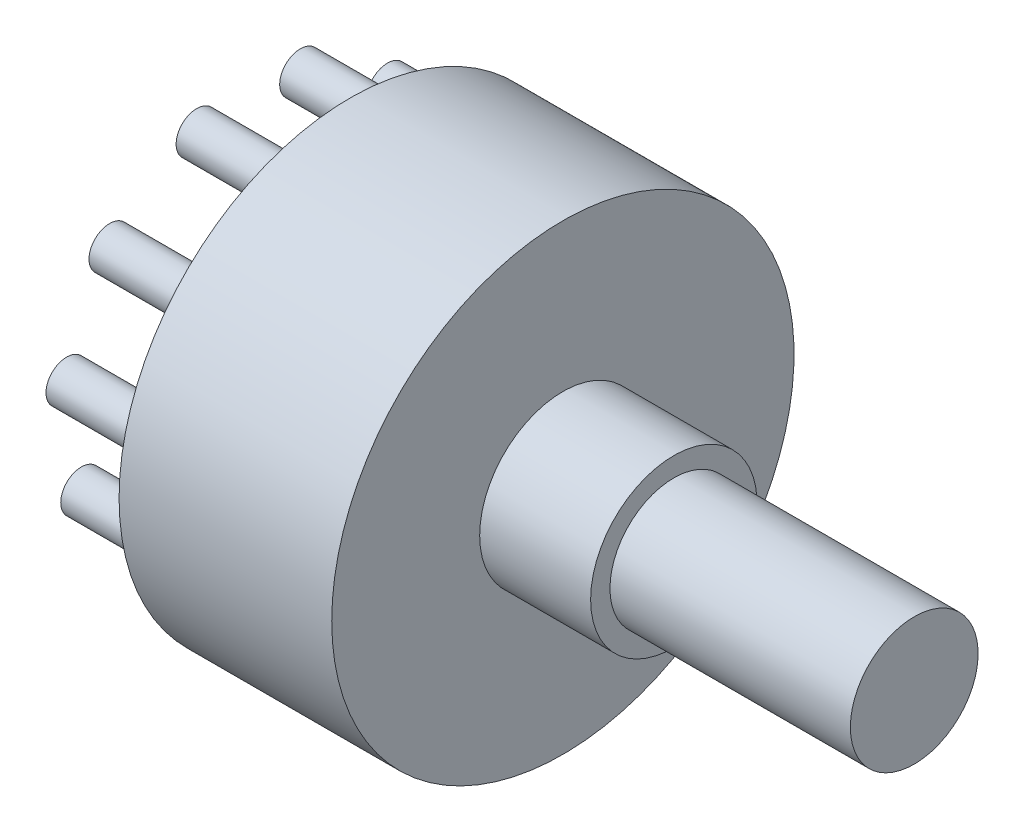
ISO-10303-21;
HEADER;
FILE_DESCRIPTION(('STEP AP214'),'2;1');
FILE_NAME('part.step','',(''),(''),'','','');
FILE_SCHEMA(('AUTOMOTIVE_DESIGN { 1 0 10303 214 1 1 1 1 }'));
ENDSEC;
DATA;
#1=APPLICATION_CONTEXT('core data for automotive mechanical design processes');
#2=APPLICATION_PROTOCOL_DEFINITION('international standard','automotive_design',2000,#1);
#3=PRODUCT_CONTEXT('',#1,'mechanical');
#4=PRODUCT('Part','Part','',(#3));
#5=PRODUCT_RELATED_PRODUCT_CATEGORY('part','',(#4));
#6=PRODUCT_DEFINITION_FORMATION('','',#4);
#7=PRODUCT_DEFINITION_CONTEXT('part definition',#1,'design');
#8=PRODUCT_DEFINITION('design','',#6,#7);
#9=PRODUCT_DEFINITION_SHAPE('','',#8);
#10=(LENGTH_UNIT() NAMED_UNIT(*) SI_UNIT(.MILLI.,.METRE.));
#11=(NAMED_UNIT(*) PLANE_ANGLE_UNIT() SI_UNIT($,.RADIAN.));
#12=(NAMED_UNIT(*) SI_UNIT($,.STERADIAN.) SOLID_ANGLE_UNIT());
#13=UNCERTAINTY_MEASURE_WITH_UNIT(LENGTH_MEASURE(1.E-05),#10,'distance_accuracy_value','');
#14=(GEOMETRIC_REPRESENTATION_CONTEXT(3) GLOBAL_UNCERTAINTY_ASSIGNED_CONTEXT((#13)) GLOBAL_UNIT_ASSIGNED_CONTEXT((#10,
#11,#12)) REPRESENTATION_CONTEXT('',''));
#15=CARTESIAN_POINT('',(0.,0.,0.));
#16=DIRECTION('',(0.,0.,1.));
#17=DIRECTION('',(1.,0.,0.));
#18=AXIS2_PLACEMENT_3D('',#15,#16,#17);
#19=CARTESIAN_POINT('',(17.,0.,0.));
#20=DIRECTION('',(1.,0.,0.));
#21=DIRECTION('',(0.,0.,-1.));
#22=AXIS2_PLACEMENT_3D('',#19,#20,#21);
#23=PLANE('',#22);
#24=CARTESIAN_POINT('',(17.,12.5,0.));
#25=DIRECTION('',(-1.,0.,0.));
#26=DIRECTION('',(0.,0.,1.));
#27=AXIS2_PLACEMENT_3D('',#24,#25,#26);
#28=CIRCLE('',#27,4.5);
#29=CARTESIAN_POINT('',(17.,12.5,4.5));
#30=VERTEX_POINT('',#29);
#31=EDGE_CURVE('E66',#30,#30,#28,.T.);
#32=ORIENTED_EDGE('',*,*,#31,.T.);
#33=EDGE_LOOP('',(#32));
#34=FACE_BOUND('',#33,.T.);
#35=CARTESIAN_POINT('',(17.,12.5,0.));
#36=DIRECTION('',(-1.,0.,0.));
#37=DIRECTION('',(0.,0.,1.));
#38=AXIS2_PLACEMENT_3D('',#35,#36,#37);
#39=CIRCLE('',#38,12.5);
#40=CARTESIAN_POINT('',(17.,12.5,12.5));
#41=VERTEX_POINT('',#40);
#42=EDGE_CURVE('E10',#41,#41,#39,.T.);
#43=ORIENTED_EDGE('',*,*,#42,.F.);
#44=EDGE_LOOP('',(#43));
#45=FACE_BOUND('',#44,.T.);
#46=ADVANCED_FACE('F39',(#34,#45),#23,.T.);
#47=CARTESIAN_POINT('',(5.5,12.5,0.));
#48=DIRECTION('',(-1.,0.,0.));
#49=DIRECTION('',(0.,0.,1.));
#50=AXIS2_PLACEMENT_3D('',#47,#48,#49);
#51=CYLINDRICAL_SURFACE('',#50,12.5);
#52=ORIENTED_EDGE('',*,*,#42,.T.);
#53=EDGE_LOOP('',(#52));
#54=FACE_BOUND('',#53,.T.);
#55=CARTESIAN_POINT('',(5.5,12.5,0.));
#56=DIRECTION('',(-1.,0.,0.));
#57=DIRECTION('',(0.,0.,1.));
#58=AXIS2_PLACEMENT_3D('',#55,#56,#57);
#59=CIRCLE('',#58,12.5);
#60=CARTESIAN_POINT('',(5.5,12.5,12.5));
#61=VERTEX_POINT('',#60);
#62=EDGE_CURVE('E46',#61,#61,#59,.T.);
#63=ORIENTED_EDGE('',*,*,#62,.F.);
#64=EDGE_LOOP('',(#63));
#65=FACE_BOUND('',#64,.T.);
#66=ADVANCED_FACE('F165',(#54,#65),#51,.T.);
#67=CARTESIAN_POINT('',(5.5,11.0582156283954,0.));
#68=DIRECTION('',(-1.,0.,0.));
#69=DIRECTION('',(0.,0.,1.));
#70=AXIS2_PLACEMENT_3D('',#67,#68,#69);
#71=PLANE('',#70);
#72=CARTESIAN_POINT('',(5.5,22.0350969053567,2.7997570641473));
#73=DIRECTION('',(-1.,0.,0.));
#74=DIRECTION('',(0.,0.,1.));
#75=AXIS2_PLACEMENT_3D('',#72,#73,#74);
#76=CIRCLE('',#75,1.11479033847051);
#77=CARTESIAN_POINT('',(5.5,22.0350969053567,3.91454740261781));
#78=VERTEX_POINT('',#77);
#79=EDGE_CURVE('E147',#78,#78,#76,.T.);
#80=ORIENTED_EDGE('',*,*,#79,.F.);
#81=EDGE_LOOP('',(#80));
#82=FACE_BOUND('',#81,.T.);
#83=CARTESIAN_POINT('',(5.5,2.56235880035982,0.));
#84=DIRECTION('',(-1.,0.,0.));
#85=DIRECTION('',(0.,0.,1.));
#86=AXIS2_PLACEMENT_3D('',#83,#84,#85);
#87=CIRCLE('',#86,1.11479033847051);
#88=CARTESIAN_POINT('',(5.5,2.56235880035982,1.11479033847051));
#89=VERTEX_POINT('',#88);
#90=EDGE_CURVE('E139',#89,#89,#87,.T.);
#91=ORIENTED_EDGE('',*,*,#90,.F.);
#92=EDGE_LOOP('',(#91));
#93=FACE_BOUND('',#92,.T.);
#94=CARTESIAN_POINT('',(5.5,8.37175465184329,-9.03959639354591));
#95=DIRECTION('',(-1.,0.,0.));
#96=DIRECTION('',(0.,0.,1.));
#97=AXIS2_PLACEMENT_3D('',#94,#95,#96);
#98=CIRCLE('',#97,1.11479033847051);
#99=CARTESIAN_POINT('',(5.5,8.37175465184329,-7.92480605507541));
#100=VERTEX_POINT('',#99);
#101=EDGE_CURVE('E131',#100,#100,#98,.T.);
#102=ORIENTED_EDGE('',*,*,#101,.F.);
#103=EDGE_LOOP('',(#102));
#104=FACE_BOUND('',#103,.T.);
#105=CARTESIAN_POINT('',(5.5,13.9142738001446,-9.83649034112322));
#106=DIRECTION('',(-1.,0.,0.));
#107=DIRECTION('',(0.,0.,1.));
#108=AXIS2_PLACEMENT_3D('',#105,#106,#107);
#109=CIRCLE('',#108,1.11479033847051);
#110=CARTESIAN_POINT('',(5.5,13.9142738001446,-8.72170000265271));
#111=VERTEX_POINT('',#110);
#112=EDGE_CURVE('E123',#111,#111,#109,.T.);
#113=ORIENTED_EDGE('',*,*,#112,.F.);
#114=EDGE_LOOP('',(#113));
#115=FACE_BOUND('',#114,.T.);
#116=CARTESIAN_POINT('',(5.5,19.0077710096812,-7.51036810671346));
#117=DIRECTION('',(-1.,0.,0.));
#118=DIRECTION('',(0.,0.,1.));
#119=AXIS2_PLACEMENT_3D('',#116,#117,#118);
#120=CIRCLE('',#119,1.1147903384705);
#121=CARTESIAN_POINT('',(5.5,19.0077710096812,-6.39557776824295));
#122=VERTEX_POINT('',#121);
#123=EDGE_CURVE('E115',#122,#122,#120,.T.);
#124=ORIENTED_EDGE('',*,*,#123,.F.);
#125=EDGE_LOOP('',(#124));
#126=FACE_BOUND('',#125,.T.);
#127=CARTESIAN_POINT('',(5.5,22.0350969053567,-2.79975706414743));
#128=DIRECTION('',(-1.,0.,0.));
#129=DIRECTION('',(0.,0.,1.));
#130=AXIS2_PLACEMENT_3D('',#127,#128,#129);
#131=CIRCLE('',#130,1.1147903384705);
#132=CARTESIAN_POINT('',(5.5,22.0350969053567,-1.68496672567693));
#133=VERTEX_POINT('',#132);
#134=EDGE_CURVE('E107',#133,#133,#131,.T.);
#135=ORIENTED_EDGE('',*,*,#134,.F.);
#136=EDGE_LOOP('',(#135));
#137=FACE_BOUND('',#136,.T.);
#138=CARTESIAN_POINT('',(5.5,19.0077710096813,7.51036810671337));
#139=DIRECTION('',(-1.,0.,0.));
#140=DIRECTION('',(0.,0.,1.));
#141=AXIS2_PLACEMENT_3D('',#138,#139,#140);
#142=CIRCLE('',#141,1.11479033847051);
#143=CARTESIAN_POINT('',(5.5,19.0077710096813,8.62515844518388));
#144=VERTEX_POINT('',#143);
#145=EDGE_CURVE('E99',#144,#144,#142,.T.);
#146=ORIENTED_EDGE('',*,*,#145,.F.);
#147=EDGE_LOOP('',(#146));
#148=FACE_BOUND('',#147,.T.);
#149=CARTESIAN_POINT('',(5.5,13.9142738001448,9.8364903411232));
#150=DIRECTION('',(-1.,0.,0.));
#151=DIRECTION('',(0.,0.,1.));
#152=AXIS2_PLACEMENT_3D('',#149,#150,#151);
#153=CIRCLE('',#152,1.11479033847051);
#154=CARTESIAN_POINT('',(5.5,13.9142738001448,10.9512806795937));
#155=VERTEX_POINT('',#154);
#156=EDGE_CURVE('E91',#155,#155,#153,.T.);
#157=ORIENTED_EDGE('',*,*,#156,.F.);
#158=EDGE_LOOP('',(#157));
#159=FACE_BOUND('',#158,.T.);
#160=CARTESIAN_POINT('',(5.5,8.37175465184341,9.03959639354598));
#161=DIRECTION('',(-1.,0.,0.));
#162=DIRECTION('',(0.,0.,1.));
#163=AXIS2_PLACEMENT_3D('',#160,#161,#162);
#164=CIRCLE('',#163,1.11479033847051);
#165=CARTESIAN_POINT('',(5.5,8.37175465184341,10.1543867320165));
#166=VERTEX_POINT('',#165);
#167=EDGE_CURVE('E83',#166,#166,#164,.T.);
#168=ORIENTED_EDGE('',*,*,#167,.F.);
#169=EDGE_LOOP('',(#168));
#170=FACE_BOUND('',#169,.T.);
#171=CARTESIAN_POINT('',(5.5,4.13992423279401,5.3726944617539));
#172=DIRECTION('',(-1.,0.,0.));
#173=DIRECTION('',(0.,0.,1.));
#174=AXIS2_PLACEMENT_3D('',#171,#172,#173);
#175=CIRCLE('',#174,1.11479033847051);
#176=CARTESIAN_POINT('',(5.5,4.13992423279401,6.48748480022441));
#177=VERTEX_POINT('',#176);
#178=EDGE_CURVE('E75',#177,#177,#175,.T.);
#179=ORIENTED_EDGE('',*,*,#178,.F.);
#180=EDGE_LOOP('',(#179));
#181=FACE_BOUND('',#180,.T.);
#182=CARTESIAN_POINT('',(5.5,4.13992423279393,-5.37269446175378));
#183=DIRECTION('',(-1.,0.,0.));
#184=DIRECTION('',(0.,0.,1.));
#185=AXIS2_PLACEMENT_3D('',#182,#183,#184);
#186=CIRCLE('',#185,1.11479033847051);
#187=CARTESIAN_POINT('',(5.5,4.13992423279393,-4.25790412328327));
#188=VERTEX_POINT('',#187);
#189=EDGE_CURVE('E71',#188,#188,#186,.T.);
#190=ORIENTED_EDGE('',*,*,#189,.F.);
#191=EDGE_LOOP('',(#190));
#192=FACE_BOUND('',#191,.T.);
#193=ORIENTED_EDGE('',*,*,#62,.T.);
#194=EDGE_LOOP('',(#193));
#195=FACE_BOUND('',#194,.T.);
#196=ADVANCED_FACE('F161',(#82,#93,#104,#115,#126,#137,#148,#159,#170,#181,#192,#195),#71,.T.);
#197=CARTESIAN_POINT('',(36.,12.5,0.));
#198=DIRECTION('',(1.,0.,0.));
#199=DIRECTION('',(0.,0.,-1.));
#200=AXIS2_PLACEMENT_3D('',#197,#198,#199);
#201=PLANE('',#200);
#202=CARTESIAN_POINT('',(36.,12.5,0.));
#203=DIRECTION('',(-1.,0.,0.));
#204=DIRECTION('',(0.,0.,1.));
#205=AXIS2_PLACEMENT_3D('',#202,#203,#204);
#206=CIRCLE('',#205,3.4544447053662);
#207=CARTESIAN_POINT('',(36.,12.5,3.4544447053662));
#208=VERTEX_POINT('',#207);
#209=EDGE_CURVE('E51',#208,#208,#206,.T.);
#210=ORIENTED_EDGE('',*,*,#209,.F.);
#211=EDGE_LOOP('',(#210));
#212=FACE_BOUND('',#211,.T.);
#213=ADVANCED_FACE('F164',(#212),#201,.T.);
#214=CARTESIAN_POINT('',(5.5,12.5,0.));
#215=DIRECTION('',(-1.,0.,0.));
#216=DIRECTION('',(0.,0.,1.));
#217=AXIS2_PLACEMENT_3D('',#214,#215,#216);
#218=CYLINDRICAL_SURFACE('',#217,3.4544447053662);
#219=ORIENTED_EDGE('',*,*,#209,.T.);
#220=EDGE_LOOP('',(#219));
#221=FACE_BOUND('',#220,.T.);
#222=CARTESIAN_POINT('',(23.,12.5,0.));
#223=DIRECTION('',(-1.,0.,0.));
#224=DIRECTION('',(0.,0.,1.));
#225=AXIS2_PLACEMENT_3D('',#222,#223,#224);
#226=CIRCLE('',#225,3.4544447053662);
#227=CARTESIAN_POINT('',(23.,12.5,3.4544447053662));
#228=VERTEX_POINT('',#227);
#229=EDGE_CURVE('E56',#228,#228,#226,.T.);
#230=ORIENTED_EDGE('',*,*,#229,.F.);
#231=EDGE_LOOP('',(#230));
#232=FACE_BOUND('',#231,.T.);
#233=ADVANCED_FACE('F218',(#221,#232),#218,.T.);
#234=CARTESIAN_POINT('',(23.,8.,0.));
#235=DIRECTION('',(1.,0.,0.));
#236=DIRECTION('',(0.,0.,-1.));
#237=AXIS2_PLACEMENT_3D('',#234,#235,#236);
#238=PLANE('',#237);
#239=ORIENTED_EDGE('',*,*,#229,.T.);
#240=EDGE_LOOP('',(#239));
#241=FACE_BOUND('',#240,.T.);
#242=CARTESIAN_POINT('',(23.,12.5,0.));
#243=DIRECTION('',(-1.,0.,0.));
#244=DIRECTION('',(0.,0.,1.));
#245=AXIS2_PLACEMENT_3D('',#242,#243,#244);
#246=CIRCLE('',#245,4.5);
#247=CARTESIAN_POINT('',(23.,12.5,4.5));
#248=VERTEX_POINT('',#247);
#249=EDGE_CURVE('E62',#248,#248,#246,.T.);
#250=ORIENTED_EDGE('',*,*,#249,.F.);
#251=EDGE_LOOP('',(#250));
#252=FACE_BOUND('',#251,.T.);
#253=ADVANCED_FACE('F200',(#241,#252),#238,.T.);
#254=CARTESIAN_POINT('',(5.5,12.5,0.));
#255=DIRECTION('',(-1.,0.,0.));
#256=DIRECTION('',(0.,0.,1.));
#257=AXIS2_PLACEMENT_3D('',#254,#255,#256);
#258=CYLINDRICAL_SURFACE('',#257,4.5);
#259=ORIENTED_EDGE('',*,*,#249,.T.);
#260=EDGE_LOOP('',(#259));
#261=FACE_BOUND('',#260,.T.);
#262=ORIENTED_EDGE('',*,*,#31,.F.);
#263=EDGE_LOOP('',(#262));
#264=FACE_BOUND('',#263,.T.);
#265=ADVANCED_FACE('F190',(#261,#264),#258,.T.);
#266=CARTESIAN_POINT('',(0.,4.13992423279393,-5.37269446175378));
#267=DIRECTION('',(1.,0.,0.));
#268=DIRECTION('',(0.,0.,-1.));
#269=AXIS2_PLACEMENT_3D('',#266,#267,#268);
#270=CYLINDRICAL_SURFACE('',#269,1.11479033847051);
#271=CARTESIAN_POINT('',(0.,4.13992423279393,-5.37269446175378));
#272=DIRECTION('',(-1.,0.,0.));
#273=DIRECTION('',(0.,0.,1.));
#274=AXIS2_PLACEMENT_3D('',#271,#272,#273);
#275=CIRCLE('',#274,1.11479033847051);
#276=CARTESIAN_POINT('',(0.,4.13992423279393,-4.25790412328327));
#277=VERTEX_POINT('',#276);
#278=EDGE_CURVE('E70',#277,#277,#275,.T.);
#279=ORIENTED_EDGE('',*,*,#278,.F.);
#280=EDGE_LOOP('',(#279));
#281=FACE_BOUND('',#280,.T.);
#282=ORIENTED_EDGE('',*,*,#189,.T.);
#283=EDGE_LOOP('',(#282));
#284=FACE_BOUND('',#283,.T.);
#285=ADVANCED_FACE('F187',(#281,#284),#270,.T.);
#286=CARTESIAN_POINT('',(0.,0.,0.));
#287=DIRECTION('',(-1.,0.,0.));
#288=DIRECTION('',(0.,0.,1.));
#289=AXIS2_PLACEMENT_3D('',#286,#287,#288);
#290=PLANE('',#289);
#291=ORIENTED_EDGE('',*,*,#278,.T.);
#292=EDGE_LOOP('',(#291));
#293=FACE_BOUND('',#292,.T.);
#294=ADVANCED_FACE('F189',(#293),#290,.T.);
#295=CARTESIAN_POINT('',(0.,4.13992423279401,5.3726944617539));
#296=DIRECTION('',(1.,0.,0.));
#297=DIRECTION('',(0.,0.,-1.));
#298=AXIS2_PLACEMENT_3D('',#295,#296,#297);
#299=CYLINDRICAL_SURFACE('',#298,1.11479033847051);
#300=CARTESIAN_POINT('',(0.,4.13992423279401,5.3726944617539));
#301=DIRECTION('',(-1.,0.,0.));
#302=DIRECTION('',(0.,0.,1.));
#303=AXIS2_PLACEMENT_3D('',#300,#301,#302);
#304=CIRCLE('',#303,1.11479033847051);
#305=CARTESIAN_POINT('',(0.,4.13992423279401,6.48748480022441));
#306=VERTEX_POINT('',#305);
#307=EDGE_CURVE('E79',#306,#306,#304,.T.);
#308=ORIENTED_EDGE('',*,*,#307,.F.);
#309=EDGE_LOOP('',(#308));
#310=FACE_BOUND('',#309,.T.);
#311=ORIENTED_EDGE('',*,*,#178,.T.);
#312=EDGE_LOOP('',(#311));
#313=FACE_BOUND('',#312,.T.);
#314=ADVANCED_FACE('F197',(#310,#313),#299,.T.);
#315=CARTESIAN_POINT('',(0.,0.,0.));
#316=DIRECTION('',(-1.,0.,0.));
#317=DIRECTION('',(0.,0.,1.));
#318=AXIS2_PLACEMENT_3D('',#315,#316,#317);
#319=PLANE('',#318);
#320=ORIENTED_EDGE('',*,*,#307,.T.);
#321=EDGE_LOOP('',(#320));
#322=FACE_BOUND('',#321,.T.);
#323=ADVANCED_FACE('F264',(#322),#319,.T.);
#324=CARTESIAN_POINT('',(0.,8.37175465184341,9.03959639354598));
#325=DIRECTION('',(1.,0.,0.));
#326=DIRECTION('',(0.,0.,-1.));
#327=AXIS2_PLACEMENT_3D('',#324,#325,#326);
#328=CYLINDRICAL_SURFACE('',#327,1.11479033847051);
#329=CARTESIAN_POINT('',(0.,8.37175465184341,9.03959639354598));
#330=DIRECTION('',(-1.,0.,0.));
#331=DIRECTION('',(0.,0.,1.));
#332=AXIS2_PLACEMENT_3D('',#329,#330,#331);
#333=CIRCLE('',#332,1.11479033847051);
#334=CARTESIAN_POINT('',(0.,8.37175465184341,10.1543867320165));
#335=VERTEX_POINT('',#334);
#336=EDGE_CURVE('E87',#335,#335,#333,.T.);
#337=ORIENTED_EDGE('',*,*,#336,.F.);
#338=EDGE_LOOP('',(#337));
#339=FACE_BOUND('',#338,.T.);
#340=ORIENTED_EDGE('',*,*,#167,.T.);
#341=EDGE_LOOP('',(#340));
#342=FACE_BOUND('',#341,.T.);
#343=ADVANCED_FACE('F274',(#339,#342),#328,.T.);
#344=CARTESIAN_POINT('',(0.,0.,0.));
#345=DIRECTION('',(-1.,0.,0.));
#346=DIRECTION('',(0.,0.,1.));
#347=AXIS2_PLACEMENT_3D('',#344,#345,#346);
#348=PLANE('',#347);
#349=ORIENTED_EDGE('',*,*,#336,.T.);
#350=EDGE_LOOP('',(#349));
#351=FACE_BOUND('',#350,.T.);
#352=ADVANCED_FACE('F284',(#351),#348,.T.);
#353=CARTESIAN_POINT('',(0.,13.9142738001448,9.8364903411232));
#354=DIRECTION('',(1.,0.,0.));
#355=DIRECTION('',(0.,0.,-1.));
#356=AXIS2_PLACEMENT_3D('',#353,#354,#355);
#357=CYLINDRICAL_SURFACE('',#356,1.11479033847051);
#358=CARTESIAN_POINT('',(0.,13.9142738001448,9.8364903411232));
#359=DIRECTION('',(-1.,0.,0.));
#360=DIRECTION('',(0.,0.,1.));
#361=AXIS2_PLACEMENT_3D('',#358,#359,#360);
#362=CIRCLE('',#361,1.11479033847051);
#363=CARTESIAN_POINT('',(0.,13.9142738001448,10.9512806795937));
#364=VERTEX_POINT('',#363);
#365=EDGE_CURVE('E95',#364,#364,#362,.T.);
#366=ORIENTED_EDGE('',*,*,#365,.F.);
#367=EDGE_LOOP('',(#366));
#368=FACE_BOUND('',#367,.T.);
#369=ORIENTED_EDGE('',*,*,#156,.T.);
#370=EDGE_LOOP('',(#369));
#371=FACE_BOUND('',#370,.T.);
#372=ADVANCED_FACE('F294',(#368,#371),#357,.T.);
#373=CARTESIAN_POINT('',(0.,0.,0.));
#374=DIRECTION('',(-1.,0.,0.));
#375=DIRECTION('',(0.,0.,1.));
#376=AXIS2_PLACEMENT_3D('',#373,#374,#375);
#377=PLANE('',#376);
#378=ORIENTED_EDGE('',*,*,#365,.T.);
#379=EDGE_LOOP('',(#378));
#380=FACE_BOUND('',#379,.T.);
#381=ADVANCED_FACE('F304',(#380),#377,.T.);
#382=CARTESIAN_POINT('',(0.,19.0077710096813,7.51036810671337));
#383=DIRECTION('',(1.,0.,0.));
#384=DIRECTION('',(0.,0.,-1.));
#385=AXIS2_PLACEMENT_3D('',#382,#383,#384);
#386=CYLINDRICAL_SURFACE('',#385,1.11479033847051);
#387=CARTESIAN_POINT('',(0.,19.0077710096813,7.51036810671337));
#388=DIRECTION('',(-1.,0.,0.));
#389=DIRECTION('',(0.,0.,1.));
#390=AXIS2_PLACEMENT_3D('',#387,#388,#389);
#391=CIRCLE('',#390,1.11479033847051);
#392=CARTESIAN_POINT('',(0.,19.0077710096813,8.62515844518388));
#393=VERTEX_POINT('',#392);
#394=EDGE_CURVE('E103',#393,#393,#391,.T.);
#395=ORIENTED_EDGE('',*,*,#394,.F.);
#396=EDGE_LOOP('',(#395));
#397=FACE_BOUND('',#396,.T.);
#398=ORIENTED_EDGE('',*,*,#145,.T.);
#399=EDGE_LOOP('',(#398));
#400=FACE_BOUND('',#399,.T.);
#401=ADVANCED_FACE('F314',(#397,#400),#386,.T.);
#402=CARTESIAN_POINT('',(0.,0.,0.));
#403=DIRECTION('',(-1.,0.,0.));
#404=DIRECTION('',(0.,0.,1.));
#405=AXIS2_PLACEMENT_3D('',#402,#403,#404);
#406=PLANE('',#405);
#407=ORIENTED_EDGE('',*,*,#394,.T.);
#408=EDGE_LOOP('',(#407));
#409=FACE_BOUND('',#408,.T.);
#410=ADVANCED_FACE('F324',(#409),#406,.T.);
#411=CARTESIAN_POINT('',(0.,22.0350969053567,-2.79975706414743));
#412=DIRECTION('',(1.,0.,0.));
#413=DIRECTION('',(0.,0.,-1.));
#414=AXIS2_PLACEMENT_3D('',#411,#412,#413);
#415=CYLINDRICAL_SURFACE('',#414,1.1147903384705);
#416=CARTESIAN_POINT('',(0.,22.0350969053567,-2.79975706414743));
#417=DIRECTION('',(-1.,0.,0.));
#418=DIRECTION('',(0.,0.,1.));
#419=AXIS2_PLACEMENT_3D('',#416,#417,#418);
#420=CIRCLE('',#419,1.1147903384705);
#421=CARTESIAN_POINT('',(0.,22.0350969053567,-1.68496672567693));
#422=VERTEX_POINT('',#421);
#423=EDGE_CURVE('E111',#422,#422,#420,.T.);
#424=ORIENTED_EDGE('',*,*,#423,.F.);
#425=EDGE_LOOP('',(#424));
#426=FACE_BOUND('',#425,.T.);
#427=ORIENTED_EDGE('',*,*,#134,.T.);
#428=EDGE_LOOP('',(#427));
#429=FACE_BOUND('',#428,.T.);
#430=ADVANCED_FACE('F334',(#426,#429),#415,.T.);
#431=CARTESIAN_POINT('',(0.,0.,0.));
#432=DIRECTION('',(-1.,0.,0.));
#433=DIRECTION('',(0.,0.,1.));
#434=AXIS2_PLACEMENT_3D('',#431,#432,#433);
#435=PLANE('',#434);
#436=ORIENTED_EDGE('',*,*,#423,.T.);
#437=EDGE_LOOP('',(#436));
#438=FACE_BOUND('',#437,.T.);
#439=ADVANCED_FACE('F344',(#438),#435,.T.);
#440=CARTESIAN_POINT('',(0.,19.0077710096812,-7.51036810671346));
#441=DIRECTION('',(1.,0.,0.));
#442=DIRECTION('',(0.,0.,-1.));
#443=AXIS2_PLACEMENT_3D('',#440,#441,#442);
#444=CYLINDRICAL_SURFACE('',#443,1.1147903384705);
#445=CARTESIAN_POINT('',(0.,19.0077710096812,-7.51036810671346));
#446=DIRECTION('',(-1.,0.,0.));
#447=DIRECTION('',(0.,0.,1.));
#448=AXIS2_PLACEMENT_3D('',#445,#446,#447);
#449=CIRCLE('',#448,1.1147903384705);
#450=CARTESIAN_POINT('',(0.,19.0077710096812,-6.39557776824295));
#451=VERTEX_POINT('',#450);
#452=EDGE_CURVE('E119',#451,#451,#449,.T.);
#453=ORIENTED_EDGE('',*,*,#452,.F.);
#454=EDGE_LOOP('',(#453));
#455=FACE_BOUND('',#454,.T.);
#456=ORIENTED_EDGE('',*,*,#123,.T.);
#457=EDGE_LOOP('',(#456));
#458=FACE_BOUND('',#457,.T.);
#459=ADVANCED_FACE('F354',(#455,#458),#444,.T.);
#460=CARTESIAN_POINT('',(0.,0.,0.));
#461=DIRECTION('',(-1.,0.,0.));
#462=DIRECTION('',(0.,0.,1.));
#463=AXIS2_PLACEMENT_3D('',#460,#461,#462);
#464=PLANE('',#463);
#465=ORIENTED_EDGE('',*,*,#452,.T.);
#466=EDGE_LOOP('',(#465));
#467=FACE_BOUND('',#466,.T.);
#468=ADVANCED_FACE('F364',(#467),#464,.T.);
#469=CARTESIAN_POINT('',(0.,13.9142738001446,-9.83649034112322));
#470=DIRECTION('',(1.,0.,0.));
#471=DIRECTION('',(0.,0.,-1.));
#472=AXIS2_PLACEMENT_3D('',#469,#470,#471);
#473=CYLINDRICAL_SURFACE('',#472,1.11479033847051);
#474=CARTESIAN_POINT('',(0.,13.9142738001446,-9.83649034112322));
#475=DIRECTION('',(-1.,0.,0.));
#476=DIRECTION('',(0.,0.,1.));
#477=AXIS2_PLACEMENT_3D('',#474,#475,#476);
#478=CIRCLE('',#477,1.11479033847051);
#479=CARTESIAN_POINT('',(0.,13.9142738001446,-8.72170000265271));
#480=VERTEX_POINT('',#479);
#481=EDGE_CURVE('E127',#480,#480,#478,.T.);
#482=ORIENTED_EDGE('',*,*,#481,.F.);
#483=EDGE_LOOP('',(#482));
#484=FACE_BOUND('',#483,.T.);
#485=ORIENTED_EDGE('',*,*,#112,.T.);
#486=EDGE_LOOP('',(#485));
#487=FACE_BOUND('',#486,.T.);
#488=ADVANCED_FACE('F374',(#484,#487),#473,.T.);
#489=CARTESIAN_POINT('',(0.,0.,0.));
#490=DIRECTION('',(-1.,0.,0.));
#491=DIRECTION('',(0.,0.,1.));
#492=AXIS2_PLACEMENT_3D('',#489,#490,#491);
#493=PLANE('',#492);
#494=ORIENTED_EDGE('',*,*,#481,.T.);
#495=EDGE_LOOP('',(#494));
#496=FACE_BOUND('',#495,.T.);
#497=ADVANCED_FACE('F384',(#496),#493,.T.);
#498=CARTESIAN_POINT('',(0.,8.37175465184329,-9.03959639354591));
#499=DIRECTION('',(1.,0.,0.));
#500=DIRECTION('',(0.,0.,-1.));
#501=AXIS2_PLACEMENT_3D('',#498,#499,#500);
#502=CYLINDRICAL_SURFACE('',#501,1.11479033847051);
#503=CARTESIAN_POINT('',(0.,8.37175465184329,-9.03959639354591));
#504=DIRECTION('',(-1.,0.,0.));
#505=DIRECTION('',(0.,0.,1.));
#506=AXIS2_PLACEMENT_3D('',#503,#504,#505);
#507=CIRCLE('',#506,1.11479033847051);
#508=CARTESIAN_POINT('',(0.,8.37175465184329,-7.92480605507541));
#509=VERTEX_POINT('',#508);
#510=EDGE_CURVE('E135',#509,#509,#507,.T.);
#511=ORIENTED_EDGE('',*,*,#510,.F.);
#512=EDGE_LOOP('',(#511));
#513=FACE_BOUND('',#512,.T.);
#514=ORIENTED_EDGE('',*,*,#101,.T.);
#515=EDGE_LOOP('',(#514));
#516=FACE_BOUND('',#515,.T.);
#517=ADVANCED_FACE('F394',(#513,#516),#502,.T.);
#518=CARTESIAN_POINT('',(0.,0.,0.));
#519=DIRECTION('',(-1.,0.,0.));
#520=DIRECTION('',(0.,0.,1.));
#521=AXIS2_PLACEMENT_3D('',#518,#519,#520);
#522=PLANE('',#521);
#523=ORIENTED_EDGE('',*,*,#510,.T.);
#524=EDGE_LOOP('',(#523));
#525=FACE_BOUND('',#524,.T.);
#526=ADVANCED_FACE('F404',(#525),#522,.T.);
#527=CARTESIAN_POINT('',(0.,2.56235880035982,0.));
#528=DIRECTION('',(1.,0.,0.));
#529=DIRECTION('',(0.,0.,-1.));
#530=AXIS2_PLACEMENT_3D('',#527,#528,#529);
#531=CYLINDRICAL_SURFACE('',#530,1.11479033847051);
#532=CARTESIAN_POINT('',(0.,2.56235880035982,0.));
#533=DIRECTION('',(-1.,0.,0.));
#534=DIRECTION('',(0.,0.,1.));
#535=AXIS2_PLACEMENT_3D('',#532,#533,#534);
#536=CIRCLE('',#535,1.11479033847051);
#537=CARTESIAN_POINT('',(0.,2.56235880035982,1.11479033847051));
#538=VERTEX_POINT('',#537);
#539=EDGE_CURVE('E143',#538,#538,#536,.T.);
#540=ORIENTED_EDGE('',*,*,#539,.F.);
#541=EDGE_LOOP('',(#540));
#542=FACE_BOUND('',#541,.T.);
#543=ORIENTED_EDGE('',*,*,#90,.T.);
#544=EDGE_LOOP('',(#543));
#545=FACE_BOUND('',#544,.T.);
#546=ADVANCED_FACE('F414',(#542,#545),#531,.T.);
#547=CARTESIAN_POINT('',(0.,2.56235880035982,0.));
#548=DIRECTION('',(-1.,0.,0.));
#549=DIRECTION('',(0.,0.,1.));
#550=AXIS2_PLACEMENT_3D('',#547,#548,#549);
#551=PLANE('',#550);
#552=ORIENTED_EDGE('',*,*,#539,.T.);
#553=EDGE_LOOP('',(#552));
#554=FACE_BOUND('',#553,.T.);
#555=ADVANCED_FACE('F424',(#554),#551,.T.);
#556=CARTESIAN_POINT('',(0.,22.0350969053567,2.7997570641473));
#557=DIRECTION('',(1.,0.,0.));
#558=DIRECTION('',(0.,0.,-1.));
#559=AXIS2_PLACEMENT_3D('',#556,#557,#558);
#560=CYLINDRICAL_SURFACE('',#559,1.11479033847051);
#561=CARTESIAN_POINT('',(0.,22.0350969053567,2.7997570641473));
#562=DIRECTION('',(-1.,0.,0.));
#563=DIRECTION('',(0.,0.,1.));
#564=AXIS2_PLACEMENT_3D('',#561,#562,#563);
#565=CIRCLE('',#564,1.11479033847051);
#566=CARTESIAN_POINT('',(0.,22.0350969053567,3.91454740261781));
#567=VERTEX_POINT('',#566);
#568=EDGE_CURVE('E151',#567,#567,#565,.T.);
#569=ORIENTED_EDGE('',*,*,#568,.F.);
#570=EDGE_LOOP('',(#569));
#571=FACE_BOUND('',#570,.T.);
#572=ORIENTED_EDGE('',*,*,#79,.T.);
#573=EDGE_LOOP('',(#572));
#574=FACE_BOUND('',#573,.T.);
#575=ADVANCED_FACE('F159',(#571,#574),#560,.T.);
#576=CARTESIAN_POINT('',(0.,22.0350969053567,2.7997570641473));
#577=DIRECTION('',(-1.,0.,0.));
#578=DIRECTION('',(0.,0.,1.));
#579=AXIS2_PLACEMENT_3D('',#576,#577,#578);
#580=PLANE('',#579);
#581=ORIENTED_EDGE('',*,*,#568,.T.);
#582=EDGE_LOOP('',(#581));
#583=FACE_BOUND('',#582,.T.);
#584=ADVANCED_FACE('F443',(#583),#580,.T.);
#585=CLOSED_SHELL('',(#46,#66,#196,#213,#233,#253,#265,#285,#294,#314,#323,#343,#352,#372,#381,
#401,#410,#430,#439,#459,#468,#488,#497,#517,#526,#546,#555,#575,#584));
#586=MANIFOLD_SOLID_BREP('B2',#585);
#587=ADVANCED_BREP_SHAPE_REPRESENTATION('',(#18,#586),#14);
#588=SHAPE_DEFINITION_REPRESENTATION(#9,#587);
ENDSEC;
END-ISO-10303-21;
